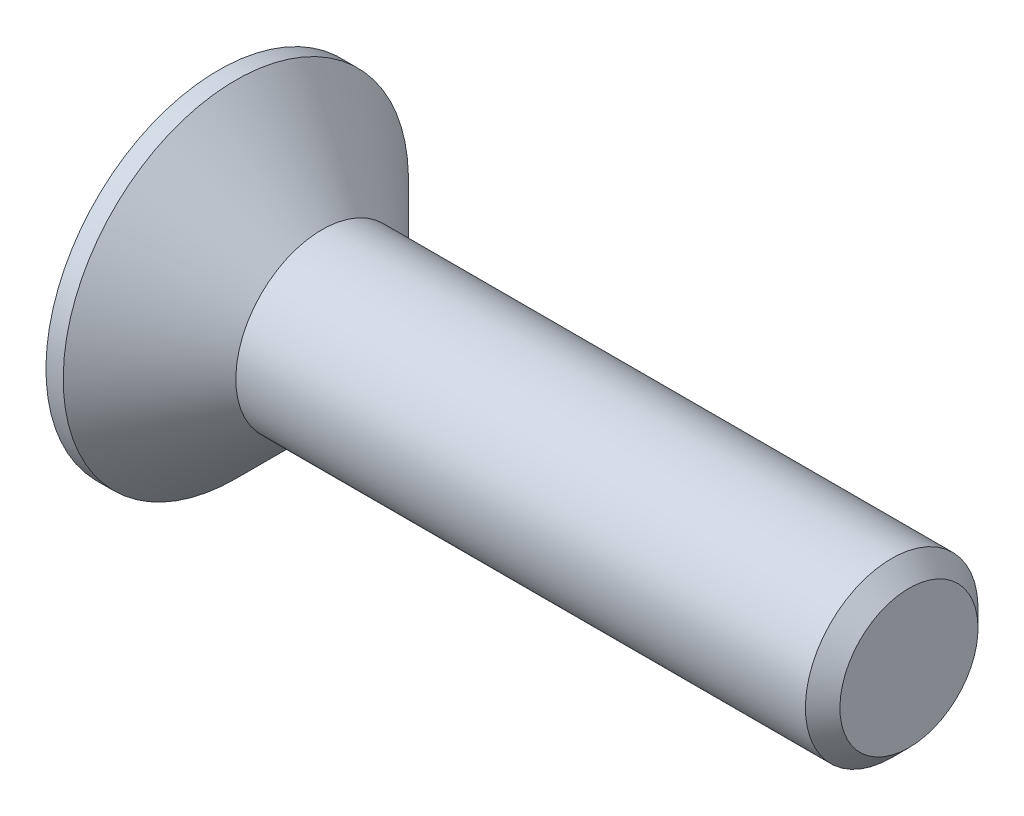
ISO-10303-21;
HEADER;
FILE_DESCRIPTION(('STEP AP214'),'2;1');
FILE_NAME('part.step','',(''),(''),'','','');
FILE_SCHEMA(('AUTOMOTIVE_DESIGN { 1 0 10303 214 1 1 1 1 }'));
ENDSEC;
DATA;
#1=APPLICATION_CONTEXT('core data for automotive mechanical design processes');
#2=APPLICATION_PROTOCOL_DEFINITION('international standard','automotive_design',2000,#1);
#3=PRODUCT_CONTEXT('',#1,'mechanical');
#4=PRODUCT('Part','Part','',(#3));
#5=PRODUCT_RELATED_PRODUCT_CATEGORY('part','',(#4));
#6=PRODUCT_DEFINITION_FORMATION('','',#4);
#7=PRODUCT_DEFINITION_CONTEXT('part definition',#1,'design');
#8=PRODUCT_DEFINITION('design','',#6,#7);
#9=PRODUCT_DEFINITION_SHAPE('','',#8);
#10=(LENGTH_UNIT() NAMED_UNIT(*) SI_UNIT(.MILLI.,.METRE.));
#11=(NAMED_UNIT(*) PLANE_ANGLE_UNIT() SI_UNIT($,.RADIAN.));
#12=(NAMED_UNIT(*) SI_UNIT($,.STERADIAN.) SOLID_ANGLE_UNIT());
#13=UNCERTAINTY_MEASURE_WITH_UNIT(LENGTH_MEASURE(1.E-05),#10,'distance_accuracy_value','');
#14=(GEOMETRIC_REPRESENTATION_CONTEXT(3) GLOBAL_UNCERTAINTY_ASSIGNED_CONTEXT((#13)) GLOBAL_UNIT_ASSIGNED_CONTEXT((#10,
#11,#12)) REPRESENTATION_CONTEXT('',''));
#15=CARTESIAN_POINT('',(0.,0.,0.));
#16=DIRECTION('',(0.,0.,1.));
#17=DIRECTION('',(1.,0.,0.));
#18=AXIS2_PLACEMENT_3D('',#15,#16,#17);
#19=CARTESIAN_POINT('',(-1.2,0.,0.));
#20=DIRECTION('',(-1.,0.,0.));
#21=DIRECTION('',(0.,-1.,0.));
#22=AXIS2_PLACEMENT_3D('',#19,#20,#21);
#23=CYLINDRICAL_SURFACE('',#22,0.999999999999999);
#24=CARTESIAN_POINT('',(6.6,0.,0.));
#25=DIRECTION('',(-1.,0.,0.));
#26=DIRECTION('',(0.,-1.,0.));
#27=AXIS2_PLACEMENT_3D('',#24,#25,#26);
#28=CIRCLE('',#27,0.999999999999999);
#29=CARTESIAN_POINT('',(6.6,-0.999999999999999,0.));
#30=VERTEX_POINT('',#29);
#31=EDGE_CURVE('E42',#30,#30,#28,.T.);
#32=ORIENTED_EDGE('',*,*,#31,.T.);
#33=EDGE_LOOP('',(#32));
#34=FACE_BOUND('',#33,.T.);
#35=CARTESIAN_POINT('',(0.,0.,0.));
#36=DIRECTION('',(-1.,0.,0.));
#37=DIRECTION('',(0.,-1.,0.));
#38=AXIS2_PLACEMENT_3D('',#35,#36,#37);
#39=CIRCLE('',#38,1.);
#40=CARTESIAN_POINT('',(0.,-1.,0.));
#41=VERTEX_POINT('',#40);
#42=EDGE_CURVE('E147',#41,#41,#39,.T.);
#43=ORIENTED_EDGE('',*,*,#42,.F.);
#44=EDGE_LOOP('',(#43));
#45=FACE_BOUND('',#44,.T.);
#46=ADVANCED_FACE('F34',(#34,#45),#23,.T.);
#47=CARTESIAN_POINT('',(0.,0.,0.));
#48=DIRECTION('',(-1.,0.,0.));
#49=DIRECTION('',(0.,-1.,0.));
#50=AXIS2_PLACEMENT_3D('',#47,#48,#49);
#51=CONICAL_SURFACE('',#50,1.,0.785398163397443);
#52=CARTESIAN_POINT('',(-1.00000000000001,0.,0.));
#53=DIRECTION('',(-1.,0.,0.));
#54=DIRECTION('',(0.,-1.,0.));
#55=AXIS2_PLACEMENT_3D('',#52,#53,#54);
#56=CIRCLE('',#55,2.);
#57=CARTESIAN_POINT('',(-1.00000000000001,-2.,0.));
#58=VERTEX_POINT('',#57);
#59=EDGE_CURVE('E144',#58,#58,#56,.T.);
#60=ORIENTED_EDGE('',*,*,#59,.F.);
#61=EDGE_LOOP('',(#60));
#62=FACE_BOUND('',#61,.T.);
#63=ORIENTED_EDGE('',*,*,#42,.T.);
#64=EDGE_LOOP('',(#63));
#65=FACE_BOUND('',#64,.T.);
#66=ADVANCED_FACE('F169',(#62,#65),#51,.T.);
#67=CARTESIAN_POINT('',(-1.2,0.,0.));
#68=DIRECTION('',(-1.,0.,0.));
#69=DIRECTION('',(0.,-1.,0.));
#70=AXIS2_PLACEMENT_3D('',#67,#68,#69);
#71=CYLINDRICAL_SURFACE('',#70,2.);
#72=CARTESIAN_POINT('',(-1.2,0.,0.));
#73=DIRECTION('',(-1.,0.,0.));
#74=DIRECTION('',(0.,-1.,0.));
#75=AXIS2_PLACEMENT_3D('',#72,#73,#74);
#76=CIRCLE('',#75,2.);
#77=CARTESIAN_POINT('',(-1.2,-2.,0.));
#78=VERTEX_POINT('',#77);
#79=EDGE_CURVE('E136',#78,#78,#76,.T.);
#80=ORIENTED_EDGE('',*,*,#79,.F.);
#81=EDGE_LOOP('',(#80));
#82=FACE_BOUND('',#81,.T.);
#83=ORIENTED_EDGE('',*,*,#59,.T.);
#84=EDGE_LOOP('',(#83));
#85=FACE_BOUND('',#84,.T.);
#86=ADVANCED_FACE('F173',(#82,#85),#71,.T.);
#87=CARTESIAN_POINT('',(-1.2,2.,0.));
#88=DIRECTION('',(1.,0.,0.));
#89=DIRECTION('',(0.,1.,0.));
#90=AXIS2_PLACEMENT_3D('',#87,#88,#89);
#91=PLANE('',#90);
#92=DIRECTION('',(0.,-0.866025403784439,0.5));
#93=VECTOR('',#92,1.);
#94=CARTESIAN_POINT('',(-1.2,0.,-0.750555349946514));
#95=LINE('',#94,#93);
#96=CARTESIAN_POINT('',(-1.2,0.,-0.750555349946513));
#97=VERTEX_POINT('',#96);
#98=CARTESIAN_POINT('',(-1.2,-0.65,-0.375277674973257));
#99=VERTEX_POINT('',#98);
#100=EDGE_CURVE('E123',#97,#99,#95,.T.);
#101=ORIENTED_EDGE('',*,*,#100,.F.);
#102=DIRECTION('',(0.,-0.866025403784438,-0.5));
#103=VECTOR('',#102,1.);
#104=CARTESIAN_POINT('',(-1.2,0.65,-0.375277674973257));
#105=LINE('',#104,#103);
#106=CARTESIAN_POINT('',(-1.2,0.65,-0.375277674973257));
#107=VERTEX_POINT('',#106);
#108=EDGE_CURVE('E49',#107,#97,#105,.T.);
#109=ORIENTED_EDGE('',*,*,#108,.F.);
#110=DIRECTION('',(0.,0.,-1.));
#111=VECTOR('',#110,1.);
#112=CARTESIAN_POINT('',(-1.2,0.65,0.375277674973257));
#113=LINE('',#112,#111);
#114=CARTESIAN_POINT('',(-1.2,0.65,0.375277674973257));
#115=VERTEX_POINT('',#114);
#116=EDGE_CURVE('E132',#115,#107,#113,.T.);
#117=ORIENTED_EDGE('',*,*,#116,.F.);
#118=DIRECTION('',(0.,0.866025403784439,-0.5));
#119=VECTOR('',#118,1.);
#120=CARTESIAN_POINT('',(-1.2,0.,0.750555349946513));
#121=LINE('',#120,#119);
#122=CARTESIAN_POINT('',(-1.2,0.,0.750555349946513));
#123=VERTEX_POINT('',#122);
#124=EDGE_CURVE('E130',#123,#115,#121,.T.);
#125=ORIENTED_EDGE('',*,*,#124,.F.);
#126=DIRECTION('',(0.,0.866025403784439,0.5));
#127=VECTOR('',#126,1.);
#128=CARTESIAN_POINT('',(-1.2,-0.65,0.375277674973257));
#129=LINE('',#128,#127);
#130=CARTESIAN_POINT('',(-1.2,-0.65,0.375277674973257));
#131=VERTEX_POINT('',#130);
#132=EDGE_CURVE('E97',#131,#123,#129,.T.);
#133=ORIENTED_EDGE('',*,*,#132,.F.);
#134=DIRECTION('',(0.,0.,1.));
#135=VECTOR('',#134,1.);
#136=CARTESIAN_POINT('',(-1.2,-0.65,-0.375277674973257));
#137=LINE('',#136,#135);
#138=EDGE_CURVE('E126',#99,#131,#137,.T.);
#139=ORIENTED_EDGE('',*,*,#138,.F.);
#140=EDGE_LOOP('',(#101,#109,#117,#125,#133,#139));
#141=FACE_BOUND('',#140,.T.);
#142=ORIENTED_EDGE('',*,*,#79,.T.);
#143=EDGE_LOOP('',(#142));
#144=FACE_BOUND('',#143,.T.);
#145=ADVANCED_FACE('F164',(#141,#144),#91,.F.);
#146=CARTESIAN_POINT('',(6.8,0.,0.));
#147=DIRECTION('',(-1.,0.,0.));
#148=DIRECTION('',(0.,-1.,0.));
#149=AXIS2_PLACEMENT_3D('',#146,#147,#148);
#150=PLANE('',#149);
#151=CARTESIAN_POINT('',(6.8,0.,0.));
#152=DIRECTION('',(-1.,0.,0.));
#153=DIRECTION('',(0.,-1.,0.));
#154=AXIS2_PLACEMENT_3D('',#151,#152,#153);
#155=CIRCLE('',#154,0.8);
#156=CARTESIAN_POINT('',(6.8,-0.8,0.));
#157=VERTEX_POINT('',#156);
#158=EDGE_CURVE('E11',#157,#157,#155,.F.);
#159=ORIENTED_EDGE('',*,*,#158,.T.);
#160=EDGE_LOOP('',(#159));
#161=FACE_BOUND('',#160,.T.);
#162=ADVANCED_FACE('F156',(#161),#150,.F.);
#163=CARTESIAN_POINT('',(6.6,0.,0.));
#164=DIRECTION('',(-1.,0.,0.));
#165=DIRECTION('',(0.,-1.,0.));
#166=AXIS2_PLACEMENT_3D('',#163,#164,#165);
#167=CONICAL_SURFACE('',#166,0.999999999999999,0.78539816339745);
#168=ORIENTED_EDGE('',*,*,#158,.F.);
#169=EDGE_LOOP('',(#168));
#170=FACE_BOUND('',#169,.T.);
#171=ORIENTED_EDGE('',*,*,#31,.F.);
#172=EDGE_LOOP('',(#171));
#173=FACE_BOUND('',#172,.T.);
#174=ADVANCED_FACE('F36',(#170,#173),#167,.T.);
#175=CARTESIAN_POINT('',(-0.45,0.65,-0.375277674973257));
#176=DIRECTION('',(0.,0.5,-0.866025403784439));
#177=DIRECTION('',(0.,0.866025403784439,0.5));
#178=AXIS2_PLACEMENT_3D('',#175,#176,#177);
#179=PLANE('',#178);
#180=ORIENTED_EDGE('',*,*,#108,.T.);
#181=DIRECTION('',(-1.,0.,0.));
#182=VECTOR('',#181,1.);
#183=CARTESIAN_POINT('',(-0.45,0.,-0.750555349946514));
#184=LINE('',#183,#182);
#185=CARTESIAN_POINT('',(-0.45,0.,-0.750555349946514));
#186=VERTEX_POINT('',#185);
#187=EDGE_CURVE('E79',#186,#97,#184,.T.);
#188=ORIENTED_EDGE('',*,*,#187,.F.);
#189=DIRECTION('',(0.,-0.866025403784438,-0.5));
#190=VECTOR('',#189,1.);
#191=CARTESIAN_POINT('',(-0.45,0.65,-0.375277674973257));
#192=LINE('',#191,#190);
#193=CARTESIAN_POINT('',(-0.45,0.65,-0.375277674973257));
#194=VERTEX_POINT('',#193);
#195=EDGE_CURVE('E134',#194,#186,#192,.T.);
#196=ORIENTED_EDGE('',*,*,#195,.F.);
#197=DIRECTION('',(-1.,0.,0.));
#198=VECTOR('',#197,1.);
#199=CARTESIAN_POINT('',(-0.45,0.65,-0.375277674973257));
#200=LINE('',#199,#198);
#201=EDGE_CURVE('E57',#194,#107,#200,.T.);
#202=ORIENTED_EDGE('',*,*,#201,.T.);
#203=EDGE_LOOP('',(#180,#188,#196,#202));
#204=FACE_BOUND('',#203,.T.);
#205=ADVANCED_FACE('F155',(#204),#179,.F.);
#206=CARTESIAN_POINT('',(-0.45,0.65,0.375277674973257));
#207=DIRECTION('',(0.,1.,0.));
#208=DIRECTION('',(0.,0.,1.));
#209=AXIS2_PLACEMENT_3D('',#206,#207,#208);
#210=PLANE('',#209);
#211=ORIENTED_EDGE('',*,*,#116,.T.);
#212=ORIENTED_EDGE('',*,*,#201,.F.);
#213=DIRECTION('',(0.,0.,-1.));
#214=VECTOR('',#213,1.);
#215=CARTESIAN_POINT('',(-0.45,0.65,0.375277674973257));
#216=LINE('',#215,#214);
#217=CARTESIAN_POINT('',(-0.45,0.65,0.375277674973257));
#218=VERTEX_POINT('',#217);
#219=EDGE_CURVE('E109',#218,#194,#216,.T.);
#220=ORIENTED_EDGE('',*,*,#219,.F.);
#221=DIRECTION('',(-1.,0.,0.));
#222=VECTOR('',#221,1.);
#223=CARTESIAN_POINT('',(-0.45,0.65,0.375277674973257));
#224=LINE('',#223,#222);
#225=EDGE_CURVE('E101',#218,#115,#224,.T.);
#226=ORIENTED_EDGE('',*,*,#225,.T.);
#227=EDGE_LOOP('',(#211,#212,#220,#226));
#228=FACE_BOUND('',#227,.T.);
#229=ADVANCED_FACE('F162',(#228),#210,.F.);
#230=CARTESIAN_POINT('',(-0.45,0.,0.750555349946513));
#231=DIRECTION('',(0.,0.5,0.866025403784439));
#232=DIRECTION('',(0.,-0.866025403784439,0.5));
#233=AXIS2_PLACEMENT_3D('',#230,#231,#232);
#234=PLANE('',#233);
#235=ORIENTED_EDGE('',*,*,#124,.T.);
#236=ORIENTED_EDGE('',*,*,#225,.F.);
#237=DIRECTION('',(0.,0.866025403784439,-0.5));
#238=VECTOR('',#237,1.);
#239=CARTESIAN_POINT('',(-0.45,0.,0.750555349946513));
#240=LINE('',#239,#238);
#241=CARTESIAN_POINT('',(-0.45,0.,0.750555349946513));
#242=VERTEX_POINT('',#241);
#243=EDGE_CURVE('E105',#242,#218,#240,.T.);
#244=ORIENTED_EDGE('',*,*,#243,.F.);
#245=DIRECTION('',(-1.,0.,0.));
#246=VECTOR('',#245,1.);
#247=CARTESIAN_POINT('',(-0.45,0.,0.750555349946513));
#248=LINE('',#247,#246);
#249=EDGE_CURVE('E90',#242,#123,#248,.T.);
#250=ORIENTED_EDGE('',*,*,#249,.T.);
#251=EDGE_LOOP('',(#235,#236,#244,#250));
#252=FACE_BOUND('',#251,.T.);
#253=ADVANCED_FACE('F106',(#252),#234,.F.);
#254=CARTESIAN_POINT('',(-0.45,-0.65,0.375277674973257));
#255=DIRECTION('',(0.,-0.5,0.866025403784439));
#256=DIRECTION('',(0.,-0.866025403784439,-0.5));
#257=AXIS2_PLACEMENT_3D('',#254,#255,#256);
#258=PLANE('',#257);
#259=ORIENTED_EDGE('',*,*,#132,.T.);
#260=ORIENTED_EDGE('',*,*,#249,.F.);
#261=DIRECTION('',(0.,0.866025403784439,0.5));
#262=VECTOR('',#261,1.);
#263=CARTESIAN_POINT('',(-0.45,-0.65,0.375277674973257));
#264=LINE('',#263,#262);
#265=CARTESIAN_POINT('',(-0.45,-0.65,0.375277674973257));
#266=VERTEX_POINT('',#265);
#267=EDGE_CURVE('E94',#266,#242,#264,.T.);
#268=ORIENTED_EDGE('',*,*,#267,.F.);
#269=DIRECTION('',(-1.,0.,0.));
#270=VECTOR('',#269,1.);
#271=CARTESIAN_POINT('',(-0.45,-0.65,0.375277674973257));
#272=LINE('',#271,#270);
#273=EDGE_CURVE('E102',#266,#131,#272,.T.);
#274=ORIENTED_EDGE('',*,*,#273,.T.);
#275=EDGE_LOOP('',(#259,#260,#268,#274));
#276=FACE_BOUND('',#275,.T.);
#277=ADVANCED_FACE('F92',(#276),#258,.F.);
#278=CARTESIAN_POINT('',(-0.45,-0.65,-0.375277674973257));
#279=DIRECTION('',(0.,-1.,0.));
#280=DIRECTION('',(0.,0.,-1.));
#281=AXIS2_PLACEMENT_3D('',#278,#279,#280);
#282=PLANE('',#281);
#283=ORIENTED_EDGE('',*,*,#138,.T.);
#284=ORIENTED_EDGE('',*,*,#273,.F.);
#285=DIRECTION('',(0.,0.,1.));
#286=VECTOR('',#285,1.);
#287=CARTESIAN_POINT('',(-0.45,-0.65,-0.375277674973257));
#288=LINE('',#287,#286);
#289=CARTESIAN_POINT('',(-0.45,-0.65,-0.375277674973257));
#290=VERTEX_POINT('',#289);
#291=EDGE_CURVE('E115',#290,#266,#288,.T.);
#292=ORIENTED_EDGE('',*,*,#291,.F.);
#293=DIRECTION('',(-1.,0.,0.));
#294=VECTOR('',#293,1.);
#295=CARTESIAN_POINT('',(-0.45,-0.65,-0.375277674973257));
#296=LINE('',#295,#294);
#297=EDGE_CURVE('E139',#290,#99,#296,.T.);
#298=ORIENTED_EDGE('',*,*,#297,.T.);
#299=EDGE_LOOP('',(#283,#284,#292,#298));
#300=FACE_BOUND('',#299,.T.);
#301=ADVANCED_FACE('F186',(#300),#282,.F.);
#302=CARTESIAN_POINT('',(-0.45,0.,-0.750555349946514));
#303=DIRECTION('',(0.,-0.5,-0.866025403784439));
#304=DIRECTION('',(0.,0.866025403784439,-0.5));
#305=AXIS2_PLACEMENT_3D('',#302,#303,#304);
#306=PLANE('',#305);
#307=ORIENTED_EDGE('',*,*,#100,.T.);
#308=ORIENTED_EDGE('',*,*,#297,.F.);
#309=DIRECTION('',(0.,-0.866025403784439,0.5));
#310=VECTOR('',#309,1.);
#311=CARTESIAN_POINT('',(-0.45,0.,-0.750555349946514));
#312=LINE('',#311,#310);
#313=EDGE_CURVE('E117',#186,#290,#312,.T.);
#314=ORIENTED_EDGE('',*,*,#313,.F.);
#315=ORIENTED_EDGE('',*,*,#187,.T.);
#316=EDGE_LOOP('',(#307,#308,#314,#315));
#317=FACE_BOUND('',#316,.T.);
#318=ADVANCED_FACE('F183',(#317),#306,.F.);
#319=CARTESIAN_POINT('',(-0.45,0.,0.));
#320=DIRECTION('',(-1.,0.,0.));
#321=DIRECTION('',(0.,0.,1.));
#322=AXIS2_PLACEMENT_3D('',#319,#320,#321);
#323=PLANE('',#322);
#324=ORIENTED_EDGE('',*,*,#195,.T.);
#325=ORIENTED_EDGE('',*,*,#313,.T.);
#326=ORIENTED_EDGE('',*,*,#291,.T.);
#327=ORIENTED_EDGE('',*,*,#267,.T.);
#328=ORIENTED_EDGE('',*,*,#243,.T.);
#329=ORIENTED_EDGE('',*,*,#219,.T.);
#330=EDGE_LOOP('',(#324,#325,#326,#327,#328,#329));
#331=FACE_BOUND('',#330,.T.);
#332=ADVANCED_FACE('F112',(#331),#323,.T.);
#333=CLOSED_SHELL('',(#46,#66,#86,#145,#162,#174,#205,#229,#253,#277,#301,#318,#332));
#334=MANIFOLD_SOLID_BREP('B2',#333);
#335=ADVANCED_BREP_SHAPE_REPRESENTATION('',(#18,#334),#14);
#336=SHAPE_DEFINITION_REPRESENTATION(#9,#335);
ENDSEC;
END-ISO-10303-21;
